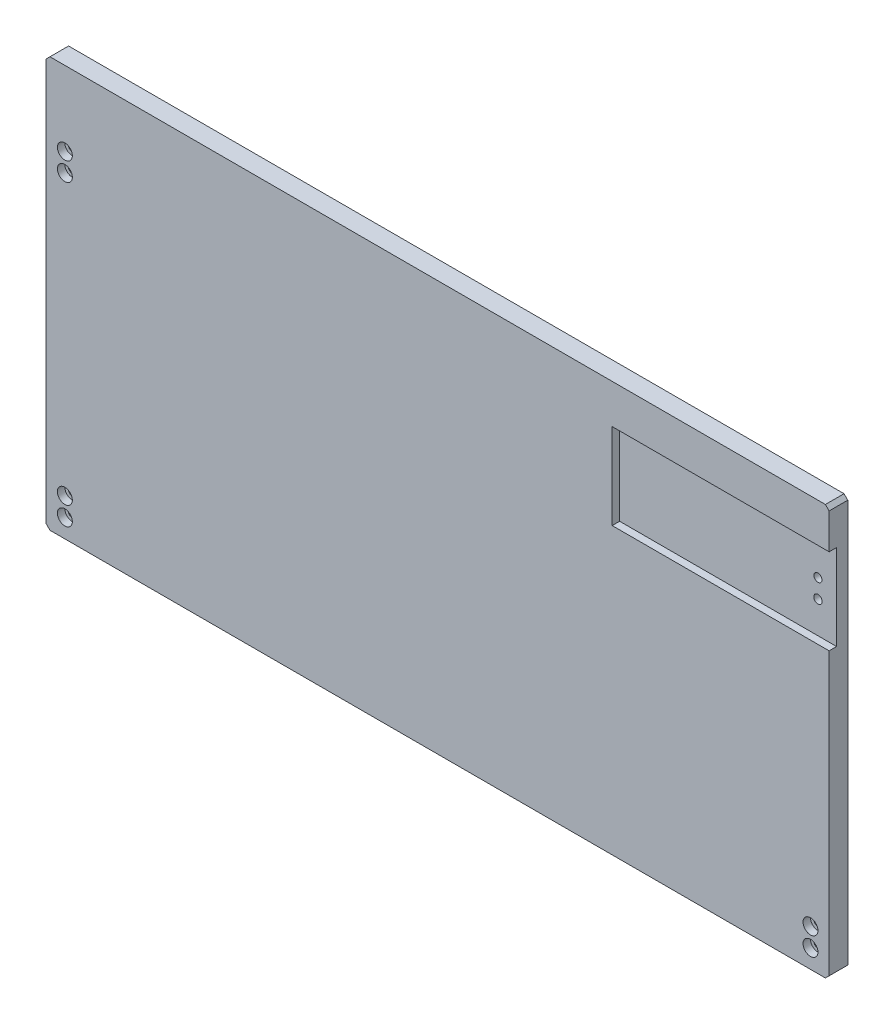
ISO-10303-21;
HEADER;
FILE_DESCRIPTION(('STEP AP214'),'2;1');
FILE_NAME('part.step','',(''),(''),'','','');
FILE_SCHEMA(('AUTOMOTIVE_DESIGN { 1 0 10303 214 1 1 1 1 }'));
ENDSEC;
DATA;
#1=APPLICATION_CONTEXT('core data for automotive mechanical design processes');
#2=APPLICATION_PROTOCOL_DEFINITION('international standard','automotive_design',2000,#1);
#3=PRODUCT_CONTEXT('',#1,'mechanical');
#4=PRODUCT('Part','Part','',(#3));
#5=PRODUCT_RELATED_PRODUCT_CATEGORY('part','',(#4));
#6=PRODUCT_DEFINITION_FORMATION('','',#4);
#7=PRODUCT_DEFINITION_CONTEXT('part definition',#1,'design');
#8=PRODUCT_DEFINITION('design','',#6,#7);
#9=PRODUCT_DEFINITION_SHAPE('','',#8);
#10=(LENGTH_UNIT() NAMED_UNIT(*) SI_UNIT(.MILLI.,.METRE.));
#11=(NAMED_UNIT(*) PLANE_ANGLE_UNIT() SI_UNIT($,.RADIAN.));
#12=(NAMED_UNIT(*) SI_UNIT($,.STERADIAN.) SOLID_ANGLE_UNIT());
#13=UNCERTAINTY_MEASURE_WITH_UNIT(LENGTH_MEASURE(1.E-05),#10,'distance_accuracy_value','');
#14=(GEOMETRIC_REPRESENTATION_CONTEXT(3) GLOBAL_UNCERTAINTY_ASSIGNED_CONTEXT((#13)) GLOBAL_UNIT_ASSIGNED_CONTEXT((#10,
#11,#12)) REPRESENTATION_CONTEXT('',''));
#15=CARTESIAN_POINT('',(0.,0.,0.));
#16=DIRECTION('',(0.,0.,1.));
#17=DIRECTION('',(1.,0.,0.));
#18=AXIS2_PLACEMENT_3D('',#15,#16,#17);
#19=CARTESIAN_POINT('',(200.,-90.,0.));
#20=DIRECTION('',(0.,0.,1.));
#21=DIRECTION('',(1.,0.,0.));
#22=AXIS2_PLACEMENT_3D('',#19,#20,#21);
#23=CYLINDRICAL_SURFACE('',#22,2.15000000000001);
#24=CARTESIAN_POINT('',(200.,-90.,0.));
#25=DIRECTION('',(0.,0.,1.));
#26=DIRECTION('',(1.,0.,0.));
#27=AXIS2_PLACEMENT_3D('',#24,#25,#26);
#28=CIRCLE('',#27,2.15000000000001);
#29=CARTESIAN_POINT('',(202.15,-90.,0.));
#30=VERTEX_POINT('',#29);
#31=EDGE_CURVE('E260',#30,#30,#28,.T.);
#32=ORIENTED_EDGE('',*,*,#31,.F.);
#33=EDGE_LOOP('',(#32));
#34=FACE_BOUND('',#33,.T.);
#35=CARTESIAN_POINT('',(200.,-90.,6.));
#36=DIRECTION('',(0.,0.,1.));
#37=DIRECTION('',(1.,0.,0.));
#38=AXIS2_PLACEMENT_3D('',#35,#36,#37);
#39=CIRCLE('',#38,2.15000000000001);
#40=CARTESIAN_POINT('',(202.15,-90.,6.));
#41=VERTEX_POINT('',#40);
#42=EDGE_CURVE('E43',#41,#41,#39,.F.);
#43=ORIENTED_EDGE('',*,*,#42,.F.);
#44=EDGE_LOOP('',(#43));
#45=FACE_BOUND('',#44,.T.);
#46=ADVANCED_FACE('F38',(#34,#45),#23,.F.);
#47=CARTESIAN_POINT('',(-200.,70.,0.));
#48=DIRECTION('',(0.,0.,1.));
#49=DIRECTION('',(1.,0.,0.));
#50=AXIS2_PLACEMENT_3D('',#47,#48,#49);
#51=CYLINDRICAL_SURFACE('',#50,2.15000000000001);
#52=CARTESIAN_POINT('',(-200.,70.,0.));
#53=DIRECTION('',(0.,0.,1.));
#54=DIRECTION('',(1.,0.,0.));
#55=AXIS2_PLACEMENT_3D('',#52,#53,#54);
#56=CIRCLE('',#55,2.15000000000001);
#57=CARTESIAN_POINT('',(-197.85,70.,0.));
#58=VERTEX_POINT('',#57);
#59=EDGE_CURVE('E269',#58,#58,#56,.T.);
#60=ORIENTED_EDGE('',*,*,#59,.F.);
#61=EDGE_LOOP('',(#60));
#62=FACE_BOUND('',#61,.T.);
#63=CARTESIAN_POINT('',(-200.,70.,6.));
#64=DIRECTION('',(0.,0.,1.));
#65=DIRECTION('',(1.,0.,0.));
#66=AXIS2_PLACEMENT_3D('',#63,#64,#65);
#67=CIRCLE('',#66,2.15000000000001);
#68=CARTESIAN_POINT('',(-197.85,70.,6.));
#69=VERTEX_POINT('',#68);
#70=EDGE_CURVE('E263',#69,#69,#67,.F.);
#71=ORIENTED_EDGE('',*,*,#70,.F.);
#72=EDGE_LOOP('',(#71));
#73=FACE_BOUND('',#72,.T.);
#74=ADVANCED_FACE('F344',(#62,#73),#51,.F.);
#75=CARTESIAN_POINT('',(-200.,-90.,0.));
#76=DIRECTION('',(0.,0.,1.));
#77=DIRECTION('',(1.,0.,0.));
#78=AXIS2_PLACEMENT_3D('',#75,#76,#77);
#79=CYLINDRICAL_SURFACE('',#78,2.15000000000001);
#80=CARTESIAN_POINT('',(-200.,-90.,0.));
#81=DIRECTION('',(0.,0.,1.));
#82=DIRECTION('',(1.,0.,0.));
#83=AXIS2_PLACEMENT_3D('',#80,#81,#82);
#84=CIRCLE('',#83,2.15000000000001);
#85=CARTESIAN_POINT('',(-197.85,-90.,0.));
#86=VERTEX_POINT('',#85);
#87=EDGE_CURVE('E273',#86,#86,#84,.T.);
#88=ORIENTED_EDGE('',*,*,#87,.F.);
#89=EDGE_LOOP('',(#88));
#90=FACE_BOUND('',#89,.T.);
#91=CARTESIAN_POINT('',(-200.,-90.,6.));
#92=DIRECTION('',(0.,0.,1.));
#93=DIRECTION('',(1.,0.,0.));
#94=AXIS2_PLACEMENT_3D('',#91,#92,#93);
#95=CIRCLE('',#94,2.15000000000001);
#96=CARTESIAN_POINT('',(-197.85,-90.,6.));
#97=VERTEX_POINT('',#96);
#98=EDGE_CURVE('E261',#97,#97,#95,.F.);
#99=ORIENTED_EDGE('',*,*,#98,.F.);
#100=EDGE_LOOP('',(#99));
#101=FACE_BOUND('',#100,.T.);
#102=ADVANCED_FACE('F350',(#90,#101),#79,.F.);
#103=CARTESIAN_POINT('',(-200.,60.,0.));
#104=DIRECTION('',(0.,0.,1.));
#105=DIRECTION('',(1.,0.,0.));
#106=AXIS2_PLACEMENT_3D('',#103,#104,#105);
#107=CYLINDRICAL_SURFACE('',#106,2.25000000000001);
#108=CARTESIAN_POINT('',(-200.,60.,0.));
#109=DIRECTION('',(0.,0.,1.));
#110=DIRECTION('',(1.,0.,0.));
#111=AXIS2_PLACEMENT_3D('',#108,#109,#110);
#112=CIRCLE('',#111,2.25000000000001);
#113=CARTESIAN_POINT('',(-197.75,60.,0.));
#114=VERTEX_POINT('',#113);
#115=EDGE_CURVE('E183',#114,#114,#112,.T.);
#116=ORIENTED_EDGE('',*,*,#115,.F.);
#117=EDGE_LOOP('',(#116));
#118=FACE_BOUND('',#117,.T.);
#119=CARTESIAN_POINT('',(-200.,60.,6.));
#120=DIRECTION('',(0.,0.,1.));
#121=DIRECTION('',(1.,0.,0.));
#122=AXIS2_PLACEMENT_3D('',#119,#120,#121);
#123=CIRCLE('',#122,2.25000000000001);
#124=CARTESIAN_POINT('',(-197.75,60.,6.));
#125=VERTEX_POINT('',#124);
#126=EDGE_CURVE('E190',#125,#125,#123,.F.);
#127=ORIENTED_EDGE('',*,*,#126,.F.);
#128=EDGE_LOOP('',(#127));
#129=FACE_BOUND('',#128,.T.);
#130=ADVANCED_FACE('F395',(#118,#129),#107,.F.);
#131=CARTESIAN_POINT('',(200.,60.,0.));
#132=DIRECTION('',(0.,0.,1.));
#133=DIRECTION('',(1.,0.,0.));
#134=AXIS2_PLACEMENT_3D('',#131,#132,#133);
#135=CYLINDRICAL_SURFACE('',#134,2.25000000000001);
#136=CARTESIAN_POINT('',(200.,60.,0.));
#137=DIRECTION('',(0.,0.,1.));
#138=DIRECTION('',(-1.,0.,0.));
#139=AXIS2_PLACEMENT_3D('',#136,#137,#138);
#140=CIRCLE('',#139,2.25000000000001);
#141=CARTESIAN_POINT('',(197.75,60.,0.));
#142=VERTEX_POINT('',#141);
#143=EDGE_CURVE('E180',#142,#142,#140,.T.);
#144=ORIENTED_EDGE('',*,*,#143,.F.);
#145=EDGE_LOOP('',(#144));
#146=FACE_BOUND('',#145,.T.);
#147=CARTESIAN_POINT('',(200.,60.,6.));
#148=DIRECTION('',(0.,0.,1.));
#149=DIRECTION('',(1.,0.,0.));
#150=AXIS2_PLACEMENT_3D('',#147,#148,#149);
#151=CIRCLE('',#150,2.25000000000001);
#152=CARTESIAN_POINT('',(202.25,60.,6.));
#153=VERTEX_POINT('',#152);
#154=EDGE_CURVE('E220',#153,#153,#151,.F.);
#155=ORIENTED_EDGE('',*,*,#154,.F.);
#156=EDGE_LOOP('',(#155));
#157=FACE_BOUND('',#156,.T.);
#158=ADVANCED_FACE('F391',(#146,#157),#135,.F.);
#159=CARTESIAN_POINT('',(200.,-100.,0.));
#160=DIRECTION('',(0.,0.,1.));
#161=DIRECTION('',(1.,0.,0.));
#162=AXIS2_PLACEMENT_3D('',#159,#160,#161);
#163=CYLINDRICAL_SURFACE('',#162,2.25000000000001);
#164=CARTESIAN_POINT('',(200.,-100.,0.));
#165=DIRECTION('',(0.,0.,1.));
#166=DIRECTION('',(1.,0.,0.));
#167=AXIS2_PLACEMENT_3D('',#164,#165,#166);
#168=CIRCLE('',#167,2.25000000000001);
#169=CARTESIAN_POINT('',(202.25,-100.,0.));
#170=VERTEX_POINT('',#169);
#171=EDGE_CURVE('E184',#170,#170,#168,.T.);
#172=ORIENTED_EDGE('',*,*,#171,.F.);
#173=EDGE_LOOP('',(#172));
#174=FACE_BOUND('',#173,.T.);
#175=CARTESIAN_POINT('',(200.,-100.,6.));
#176=DIRECTION('',(0.,0.,1.));
#177=DIRECTION('',(1.,0.,0.));
#178=AXIS2_PLACEMENT_3D('',#175,#176,#177);
#179=CIRCLE('',#178,2.25000000000001);
#180=CARTESIAN_POINT('',(202.25,-100.,6.));
#181=VERTEX_POINT('',#180);
#182=EDGE_CURVE('E217',#181,#181,#179,.F.);
#183=ORIENTED_EDGE('',*,*,#182,.F.);
#184=EDGE_LOOP('',(#183));
#185=FACE_BOUND('',#184,.T.);
#186=ADVANCED_FACE('F394',(#174,#185),#163,.F.);
#187=CARTESIAN_POINT('',(-200.,-100.,0.));
#188=DIRECTION('',(0.,0.,1.));
#189=DIRECTION('',(1.,0.,0.));
#190=AXIS2_PLACEMENT_3D('',#187,#188,#189);
#191=CYLINDRICAL_SURFACE('',#190,2.25000000000001);
#192=CARTESIAN_POINT('',(-200.,-100.,0.));
#193=DIRECTION('',(0.,0.,1.));
#194=DIRECTION('',(-1.,0.,0.));
#195=AXIS2_PLACEMENT_3D('',#192,#193,#194);
#196=CIRCLE('',#195,2.25000000000001);
#197=CARTESIAN_POINT('',(-202.25,-100.,0.));
#198=VERTEX_POINT('',#197);
#199=EDGE_CURVE('E187',#198,#198,#196,.T.);
#200=ORIENTED_EDGE('',*,*,#199,.F.);
#201=EDGE_LOOP('',(#200));
#202=FACE_BOUND('',#201,.T.);
#203=CARTESIAN_POINT('',(-200.,-100.,6.));
#204=DIRECTION('',(0.,0.,1.));
#205=DIRECTION('',(1.,0.,0.));
#206=AXIS2_PLACEMENT_3D('',#203,#204,#205);
#207=CIRCLE('',#206,2.25000000000001);
#208=CARTESIAN_POINT('',(-197.75,-100.,6.));
#209=VERTEX_POINT('',#208);
#210=EDGE_CURVE('E177',#209,#209,#207,.F.);
#211=ORIENTED_EDGE('',*,*,#210,.F.);
#212=EDGE_LOOP('',(#211));
#213=FACE_BOUND('',#212,.T.);
#214=ADVANCED_FACE('F399',(#202,#213),#191,.F.);
#215=CARTESIAN_POINT('',(210.,-110.,10.));
#216=DIRECTION('',(-1.,0.,0.));
#217=DIRECTION('',(0.,0.,1.));
#218=AXIS2_PLACEMENT_3D('',#215,#216,#217);
#219=PLANE('',#218);
#220=DIRECTION('',(0.,1.,0.));
#221=VECTOR('',#220,1.);
#222=CARTESIAN_POINT('',(210.,-110.,10.));
#223=LINE('',#222,#221);
#224=CARTESIAN_POINT('',(210.,89.,10.));
#225=VERTEX_POINT('',#224);
#226=CARTESIAN_POINT('',(210.,108.,10.));
#227=VERTEX_POINT('',#226);
#228=EDGE_CURVE('E196',#225,#227,#223,.T.);
#229=ORIENTED_EDGE('',*,*,#228,.F.);
#230=DIRECTION('',(0.,0.,1.));
#231=VECTOR('',#230,1.);
#232=CARTESIAN_POINT('',(210.,89.,10.));
#233=LINE('',#232,#231);
#234=CARTESIAN_POINT('',(210.,89.,6.));
#235=VERTEX_POINT('',#234);
#236=EDGE_CURVE('E148',#235,#225,#233,.T.);
#237=ORIENTED_EDGE('',*,*,#236,.F.);
#238=DIRECTION('',(0.,1.,0.));
#239=VECTOR('',#238,1.);
#240=CARTESIAN_POINT('',(210.,89.,6.));
#241=LINE('',#240,#239);
#242=CARTESIAN_POINT('',(210.,43.,5.99999999999999));
#243=VERTEX_POINT('',#242);
#244=EDGE_CURVE('E290',#243,#235,#241,.T.);
#245=ORIENTED_EDGE('',*,*,#244,.F.);
#246=DIRECTION('',(0.,0.,-1.));
#247=VECTOR('',#246,1.);
#248=CARTESIAN_POINT('',(210.,43.,9.99999999999999));
#249=LINE('',#248,#247);
#250=CARTESIAN_POINT('',(210.,43.,9.99999999999999));
#251=VERTEX_POINT('',#250);
#252=EDGE_CURVE('E259',#251,#243,#249,.T.);
#253=ORIENTED_EDGE('',*,*,#252,.F.);
#254=CARTESIAN_POINT('',(210.,-108.,10.));
#255=VERTEX_POINT('',#254);
#256=EDGE_CURVE('E153',#255,#251,#223,.T.);
#257=ORIENTED_EDGE('',*,*,#256,.F.);
#258=DIRECTION('',(0.,0.,-1.));
#259=VECTOR('',#258,1.);
#260=CARTESIAN_POINT('',(210.,-108.,10.));
#261=LINE('',#260,#259);
#262=CARTESIAN_POINT('',(210.,-108.,0.));
#263=VERTEX_POINT('',#262);
#264=EDGE_CURVE('E48',#255,#263,#261,.T.);
#265=ORIENTED_EDGE('',*,*,#264,.T.);
#266=DIRECTION('',(0.,1.,0.));
#267=VECTOR('',#266,1.);
#268=CARTESIAN_POINT('',(210.,-110.,0.));
#269=LINE('',#268,#267);
#270=CARTESIAN_POINT('',(210.,108.,0.));
#271=VERTEX_POINT('',#270);
#272=EDGE_CURVE('E193',#263,#271,#269,.T.);
#273=ORIENTED_EDGE('',*,*,#272,.T.);
#274=DIRECTION('',(0.,0.,1.));
#275=VECTOR('',#274,1.);
#276=CARTESIAN_POINT('',(210.,108.,10.));
#277=LINE('',#276,#275);
#278=EDGE_CURVE('E11',#271,#227,#277,.T.);
#279=ORIENTED_EDGE('',*,*,#278,.T.);
#280=EDGE_LOOP('',(#229,#237,#245,#253,#257,#265,#273,#279));
#281=FACE_BOUND('',#280,.T.);
#282=ADVANCED_FACE('F302',(#281),#219,.F.);
#283=CARTESIAN_POINT('',(-210.,110.,10.));
#284=DIRECTION('',(0.,-1.,0.));
#285=DIRECTION('',(0.,0.,-1.));
#286=AXIS2_PLACEMENT_3D('',#283,#284,#285);
#287=PLANE('',#286);
#288=DIRECTION('',(-1.,0.,0.));
#289=VECTOR('',#288,1.);
#290=CARTESIAN_POINT('',(-210.,110.,0.));
#291=LINE('',#290,#289);
#292=CARTESIAN_POINT('',(208.,110.,0.));
#293=VERTEX_POINT('',#292);
#294=CARTESIAN_POINT('',(-208.,110.,0.));
#295=VERTEX_POINT('',#294);
#296=EDGE_CURVE('E207',#293,#295,#291,.T.);
#297=ORIENTED_EDGE('',*,*,#296,.T.);
#298=DIRECTION('',(0.,0.,1.));
#299=VECTOR('',#298,1.);
#300=CARTESIAN_POINT('',(-208.,110.,10.));
#301=LINE('',#300,#299);
#302=CARTESIAN_POINT('',(-208.,110.,10.));
#303=VERTEX_POINT('',#302);
#304=EDGE_CURVE('E64',#295,#303,#301,.T.);
#305=ORIENTED_EDGE('',*,*,#304,.T.);
#306=DIRECTION('',(-1.,0.,0.));
#307=VECTOR('',#306,1.);
#308=CARTESIAN_POINT('',(-210.,110.,10.));
#309=LINE('',#308,#307);
#310=CARTESIAN_POINT('',(208.,110.,10.));
#311=VERTEX_POINT('',#310);
#312=EDGE_CURVE('E195',#311,#303,#309,.T.);
#313=ORIENTED_EDGE('',*,*,#312,.F.);
#314=DIRECTION('',(0.,0.,-1.));
#315=VECTOR('',#314,1.);
#316=CARTESIAN_POINT('',(208.,110.,10.));
#317=LINE('',#316,#315);
#318=EDGE_CURVE('E250',#311,#293,#317,.T.);
#319=ORIENTED_EDGE('',*,*,#318,.T.);
#320=EDGE_LOOP('',(#297,#305,#313,#319));
#321=FACE_BOUND('',#320,.T.);
#322=ADVANCED_FACE('F308',(#321),#287,.F.);
#323=CARTESIAN_POINT('',(-210.,-110.,10.));
#324=DIRECTION('',(1.,0.,0.));
#325=DIRECTION('',(0.,0.,-1.));
#326=AXIS2_PLACEMENT_3D('',#323,#324,#325);
#327=PLANE('',#326);
#328=DIRECTION('',(0.,-1.,0.));
#329=VECTOR('',#328,1.);
#330=CARTESIAN_POINT('',(-210.,-110.,0.));
#331=LINE('',#330,#329);
#332=CARTESIAN_POINT('',(-210.,108.,0.));
#333=VERTEX_POINT('',#332);
#334=CARTESIAN_POINT('',(-210.,-108.,0.));
#335=VERTEX_POINT('',#334);
#336=EDGE_CURVE('E209',#333,#335,#331,.T.);
#337=ORIENTED_EDGE('',*,*,#336,.T.);
#338=DIRECTION('',(0.,0.,1.));
#339=VECTOR('',#338,1.);
#340=CARTESIAN_POINT('',(-210.,-108.,10.));
#341=LINE('',#340,#339);
#342=CARTESIAN_POINT('',(-210.,-108.,10.));
#343=VERTEX_POINT('',#342);
#344=EDGE_CURVE('E240',#335,#343,#341,.T.);
#345=ORIENTED_EDGE('',*,*,#344,.T.);
#346=DIRECTION('',(0.,-1.,0.));
#347=VECTOR('',#346,1.);
#348=CARTESIAN_POINT('',(-210.,-110.,10.));
#349=LINE('',#348,#347);
#350=CARTESIAN_POINT('',(-210.,108.,10.));
#351=VERTEX_POINT('',#350);
#352=EDGE_CURVE('E198',#351,#343,#349,.T.);
#353=ORIENTED_EDGE('',*,*,#352,.F.);
#354=DIRECTION('',(0.,0.,-1.));
#355=VECTOR('',#354,1.);
#356=CARTESIAN_POINT('',(-210.,108.,10.));
#357=LINE('',#356,#355);
#358=EDGE_CURVE('E237',#351,#333,#357,.T.);
#359=ORIENTED_EDGE('',*,*,#358,.T.);
#360=EDGE_LOOP('',(#337,#345,#353,#359));
#361=FACE_BOUND('',#360,.T.);
#362=ADVANCED_FACE('F329',(#361),#327,.F.);
#363=CARTESIAN_POINT('',(-210.,-110.,10.));
#364=DIRECTION('',(0.,1.,0.));
#365=DIRECTION('',(0.,0.,1.));
#366=AXIS2_PLACEMENT_3D('',#363,#364,#365);
#367=PLANE('',#366);
#368=DIRECTION('',(1.,0.,0.));
#369=VECTOR('',#368,1.);
#370=CARTESIAN_POINT('',(-210.,-110.,10.));
#371=LINE('',#370,#369);
#372=CARTESIAN_POINT('',(-208.,-110.,10.));
#373=VERTEX_POINT('',#372);
#374=CARTESIAN_POINT('',(208.,-110.,10.));
#375=VERTEX_POINT('',#374);
#376=EDGE_CURVE('E201',#373,#375,#371,.T.);
#377=ORIENTED_EDGE('',*,*,#376,.F.);
#378=DIRECTION('',(0.,0.,-1.));
#379=VECTOR('',#378,1.);
#380=CARTESIAN_POINT('',(-208.,-110.,10.));
#381=LINE('',#380,#379);
#382=CARTESIAN_POINT('',(-208.,-110.,0.));
#383=VERTEX_POINT('',#382);
#384=EDGE_CURVE('E226',#373,#383,#381,.T.);
#385=ORIENTED_EDGE('',*,*,#384,.T.);
#386=DIRECTION('',(1.,0.,0.));
#387=VECTOR('',#386,1.);
#388=CARTESIAN_POINT('',(-210.,-110.,0.));
#389=LINE('',#388,#387);
#390=CARTESIAN_POINT('',(208.,-110.,0.));
#391=VERTEX_POINT('',#390);
#392=EDGE_CURVE('E212',#383,#391,#389,.T.);
#393=ORIENTED_EDGE('',*,*,#392,.T.);
#394=DIRECTION('',(0.,0.,1.));
#395=VECTOR('',#394,1.);
#396=CARTESIAN_POINT('',(208.,-110.,10.));
#397=LINE('',#396,#395);
#398=EDGE_CURVE('E204',#391,#375,#397,.T.);
#399=ORIENTED_EDGE('',*,*,#398,.T.);
#400=EDGE_LOOP('',(#377,#385,#393,#399));
#401=FACE_BOUND('',#400,.T.);
#402=ADVANCED_FACE('F321',(#401),#367,.F.);
#403=CARTESIAN_POINT('',(0.,0.,10.));
#404=DIRECTION('',(0.,0.,-1.));
#405=DIRECTION('',(-1.,0.,0.));
#406=AXIS2_PLACEMENT_3D('',#403,#404,#405);
#407=PLANE('',#406);
#408=CARTESIAN_POINT('',(-200.,70.,10.));
#409=DIRECTION('',(0.,0.,1.));
#410=DIRECTION('',(1.,0.,0.));
#411=AXIS2_PLACEMENT_3D('',#408,#409,#410);
#412=CIRCLE('',#411,3.99999999999999);
#413=CARTESIAN_POINT('',(-196.,70.,10.));
#414=VERTEX_POINT('',#413);
#415=EDGE_CURVE('E702',#414,#414,#412,.T.);
#416=ORIENTED_EDGE('',*,*,#415,.F.);
#417=EDGE_LOOP('',(#416));
#418=FACE_BOUND('',#417,.T.);
#419=CARTESIAN_POINT('',(-200.,-89.9999999999999,10.));
#420=DIRECTION('',(0.,0.,1.));
#421=DIRECTION('',(1.,0.,0.));
#422=AXIS2_PLACEMENT_3D('',#419,#420,#421);
#423=CIRCLE('',#422,3.99999999999999);
#424=CARTESIAN_POINT('',(-196.,-89.9999999999999,10.));
#425=VERTEX_POINT('',#424);
#426=EDGE_CURVE('E695',#425,#425,#423,.T.);
#427=ORIENTED_EDGE('',*,*,#426,.F.);
#428=EDGE_LOOP('',(#427));
#429=FACE_BOUND('',#428,.T.);
#430=CARTESIAN_POINT('',(200.,-90.,10.));
#431=DIRECTION('',(0.,0.,1.));
#432=DIRECTION('',(1.,0.,0.));
#433=AXIS2_PLACEMENT_3D('',#430,#431,#432);
#434=CIRCLE('',#433,3.99999999999999);
#435=CARTESIAN_POINT('',(204.,-90.,10.));
#436=VERTEX_POINT('',#435);
#437=EDGE_CURVE('E282',#436,#436,#434,.T.);
#438=ORIENTED_EDGE('',*,*,#437,.F.);
#439=EDGE_LOOP('',(#438));
#440=FACE_BOUND('',#439,.T.);
#441=CARTESIAN_POINT('',(-200.,-100.,10.));
#442=DIRECTION('',(0.,0.,1.));
#443=DIRECTION('',(1.,0.,0.));
#444=AXIS2_PLACEMENT_3D('',#441,#442,#443);
#445=CIRCLE('',#444,3.99999999999999);
#446=CARTESIAN_POINT('',(-196.,-100.,10.));
#447=VERTEX_POINT('',#446);
#448=EDGE_CURVE('E163',#447,#447,#445,.T.);
#449=ORIENTED_EDGE('',*,*,#448,.F.);
#450=EDGE_LOOP('',(#449));
#451=FACE_BOUND('',#450,.T.);
#452=CARTESIAN_POINT('',(200.,-100.,10.));
#453=DIRECTION('',(0.,0.,1.));
#454=DIRECTION('',(1.,0.,0.));
#455=AXIS2_PLACEMENT_3D('',#452,#453,#454);
#456=CIRCLE('',#455,3.99999999999999);
#457=CARTESIAN_POINT('',(204.,-100.,10.));
#458=VERTEX_POINT('',#457);
#459=EDGE_CURVE('E164',#458,#458,#456,.T.);
#460=ORIENTED_EDGE('',*,*,#459,.F.);
#461=EDGE_LOOP('',(#460));
#462=FACE_BOUND('',#461,.T.);
#463=CARTESIAN_POINT('',(-200.,60.,10.));
#464=DIRECTION('',(0.,0.,1.));
#465=DIRECTION('',(1.,0.,0.));
#466=AXIS2_PLACEMENT_3D('',#463,#464,#465);
#467=CIRCLE('',#466,3.99999999999999);
#468=CARTESIAN_POINT('',(-196.,60.,10.));
#469=VERTEX_POINT('',#468);
#470=EDGE_CURVE('E171',#469,#469,#467,.T.);
#471=ORIENTED_EDGE('',*,*,#470,.F.);
#472=EDGE_LOOP('',(#471));
#473=FACE_BOUND('',#472,.T.);
#474=DIRECTION('',(0.,-1.,0.));
#475=VECTOR('',#474,1.);
#476=CARTESIAN_POINT('',(93.6199999999999,89.,10.));
#477=LINE('',#476,#475);
#478=CARTESIAN_POINT('',(93.6199999999999,89.,10.));
#479=VERTEX_POINT('',#478);
#480=CARTESIAN_POINT('',(93.6199999999999,43.,9.99999999999999));
#481=VERTEX_POINT('',#480);
#482=EDGE_CURVE('E142',#479,#481,#477,.T.);
#483=ORIENTED_EDGE('',*,*,#482,.F.);
#484=DIRECTION('',(1.,0.,0.));
#485=VECTOR('',#484,1.);
#486=CARTESIAN_POINT('',(93.6199999999999,89.,10.));
#487=LINE('',#486,#485);
#488=EDGE_CURVE('E167',#479,#225,#487,.T.);
#489=ORIENTED_EDGE('',*,*,#488,.T.);
#490=ORIENTED_EDGE('',*,*,#228,.T.);
#491=DIRECTION('',(0.707106781186548,-0.707106781186548,0.));
#492=VECTOR('',#491,1.);
#493=CARTESIAN_POINT('',(208.,110.,10.));
#494=LINE('',#493,#492);
#495=EDGE_CURVE('E244',#227,#311,#494,.F.);
#496=ORIENTED_EDGE('',*,*,#495,.T.);
#497=ORIENTED_EDGE('',*,*,#312,.T.);
#498=DIRECTION('',(0.707106781186557,0.707106781186538,0.));
#499=VECTOR('',#498,1.);
#500=CARTESIAN_POINT('',(-210.,108.,10.));
#501=LINE('',#500,#499);
#502=EDGE_CURVE('E246',#303,#351,#501,.F.);
#503=ORIENTED_EDGE('',*,*,#502,.T.);
#504=ORIENTED_EDGE('',*,*,#352,.T.);
#505=DIRECTION('',(-0.707106781186548,0.707106781186548,0.));
#506=VECTOR('',#505,1.);
#507=CARTESIAN_POINT('',(-208.,-110.,10.));
#508=LINE('',#507,#506);
#509=EDGE_CURVE('E248',#343,#373,#508,.F.);
#510=ORIENTED_EDGE('',*,*,#509,.T.);
#511=ORIENTED_EDGE('',*,*,#376,.T.);
#512=DIRECTION('',(-0.707106781186557,-0.707106781186538,0.));
#513=VECTOR('',#512,1.);
#514=CARTESIAN_POINT('',(210.,-108.,10.));
#515=LINE('',#514,#513);
#516=EDGE_CURVE('E242',#375,#255,#515,.F.);
#517=ORIENTED_EDGE('',*,*,#516,.T.);
#518=ORIENTED_EDGE('',*,*,#256,.T.);
#519=DIRECTION('',(1.,0.,0.));
#520=VECTOR('',#519,1.);
#521=CARTESIAN_POINT('',(93.6199999999999,43.,9.99999999999999));
#522=LINE('',#521,#520);
#523=EDGE_CURVE('E137',#481,#251,#522,.T.);
#524=ORIENTED_EDGE('',*,*,#523,.F.);
#525=EDGE_LOOP('',(#483,#489,#490,#496,#497,#503,#504,#510,#511,#517,#518,#524));
#526=FACE_BOUND('',#525,.T.);
#527=ADVANCED_FACE('F151',(#418,#429,#440,#451,#462,#473,#526),#407,.F.);
#528=CARTESIAN_POINT('',(0.,0.,0.));
#529=DIRECTION('',(0.,0.,-1.));
#530=DIRECTION('',(-1.,0.,0.));
#531=AXIS2_PLACEMENT_3D('',#528,#529,#530);
#532=PLANE('',#531);
#533=CARTESIAN_POINT('',(200.,70.,0.));
#534=DIRECTION('',(0.,0.,1.));
#535=DIRECTION('',(1.,0.,0.));
#536=AXIS2_PLACEMENT_3D('',#533,#534,#535);
#537=CIRCLE('',#536,2.15000000000001);
#538=CARTESIAN_POINT('',(202.15,70.,0.));
#539=VERTEX_POINT('',#538);
#540=EDGE_CURVE('E278',#539,#539,#537,.T.);
#541=ORIENTED_EDGE('',*,*,#540,.T.);
#542=EDGE_LOOP('',(#541));
#543=FACE_BOUND('',#542,.T.);
#544=ORIENTED_EDGE('',*,*,#87,.T.);
#545=EDGE_LOOP('',(#544));
#546=FACE_BOUND('',#545,.T.);
#547=ORIENTED_EDGE('',*,*,#59,.T.);
#548=EDGE_LOOP('',(#547));
#549=FACE_BOUND('',#548,.T.);
#550=ORIENTED_EDGE('',*,*,#31,.T.);
#551=EDGE_LOOP('',(#550));
#552=FACE_BOUND('',#551,.T.);
#553=ORIENTED_EDGE('',*,*,#199,.T.);
#554=EDGE_LOOP('',(#553));
#555=FACE_BOUND('',#554,.T.);
#556=ORIENTED_EDGE('',*,*,#171,.T.);
#557=EDGE_LOOP('',(#556));
#558=FACE_BOUND('',#557,.T.);
#559=ORIENTED_EDGE('',*,*,#143,.T.);
#560=EDGE_LOOP('',(#559));
#561=FACE_BOUND('',#560,.T.);
#562=ORIENTED_EDGE('',*,*,#115,.T.);
#563=EDGE_LOOP('',(#562));
#564=FACE_BOUND('',#563,.T.);
#565=ORIENTED_EDGE('',*,*,#392,.F.);
#566=DIRECTION('',(0.707106781186548,-0.707106781186548,0.));
#567=VECTOR('',#566,1.);
#568=CARTESIAN_POINT('',(-159.,-159.,0.));
#569=LINE('',#568,#567);
#570=EDGE_CURVE('E235',#383,#335,#569,.F.);
#571=ORIENTED_EDGE('',*,*,#570,.T.);
#572=ORIENTED_EDGE('',*,*,#336,.F.);
#573=DIRECTION('',(-0.707106781186557,-0.707106781186538,0.));
#574=VECTOR('',#573,1.);
#575=CARTESIAN_POINT('',(-158.999999999997,159.000000000002,0.));
#576=LINE('',#575,#574);
#577=EDGE_CURVE('E233',#333,#295,#576,.F.);
#578=ORIENTED_EDGE('',*,*,#577,.T.);
#579=ORIENTED_EDGE('',*,*,#296,.F.);
#580=DIRECTION('',(-0.707106781186548,0.707106781186548,0.));
#581=VECTOR('',#580,1.);
#582=CARTESIAN_POINT('',(159.,159.,0.));
#583=LINE('',#582,#581);
#584=EDGE_CURVE('E231',#293,#271,#583,.F.);
#585=ORIENTED_EDGE('',*,*,#584,.T.);
#586=ORIENTED_EDGE('',*,*,#272,.F.);
#587=DIRECTION('',(0.707106781186557,0.707106781186538,0.));
#588=VECTOR('',#587,1.);
#589=CARTESIAN_POINT('',(158.999999999997,-159.000000000001,0.));
#590=LINE('',#589,#588);
#591=EDGE_CURVE('E229',#263,#391,#590,.F.);
#592=ORIENTED_EDGE('',*,*,#591,.T.);
#593=EDGE_LOOP('',(#565,#571,#572,#578,#579,#585,#586,#592));
#594=FACE_BOUND('',#593,.T.);
#595=ADVANCED_FACE('F314',(#543,#546,#549,#552,#555,#558,#561,#564,#594),#532,.T.);
#596=CARTESIAN_POINT('',(-200.,-100.,6.));
#597=DIRECTION('',(0.,0.,1.));
#598=DIRECTION('',(1.,0.,0.));
#599=AXIS2_PLACEMENT_3D('',#596,#597,#598);
#600=PLANE('',#599);
#601=CARTESIAN_POINT('',(-200.,-100.,6.));
#602=DIRECTION('',(0.,0.,1.));
#603=DIRECTION('',(1.,0.,0.));
#604=AXIS2_PLACEMENT_3D('',#601,#602,#603);
#605=CIRCLE('',#604,3.99999999999999);
#606=CARTESIAN_POINT('',(-196.,-100.,6.));
#607=VERTEX_POINT('',#606);
#608=EDGE_CURVE('E168',#607,#607,#605,.T.);
#609=ORIENTED_EDGE('',*,*,#608,.T.);
#610=EDGE_LOOP('',(#609));
#611=FACE_BOUND('',#610,.T.);
#612=ORIENTED_EDGE('',*,*,#210,.T.);
#613=EDGE_LOOP('',(#612));
#614=FACE_BOUND('',#613,.T.);
#615=ADVANCED_FACE('F374',(#611,#614),#600,.T.);
#616=CARTESIAN_POINT('',(-200.,-100.,6.));
#617=DIRECTION('',(0.,0.,1.));
#618=DIRECTION('',(1.,0.,0.));
#619=AXIS2_PLACEMENT_3D('',#616,#617,#618);
#620=CYLINDRICAL_SURFACE('',#619,3.99999999999999);
#621=ORIENTED_EDGE('',*,*,#608,.F.);
#622=EDGE_LOOP('',(#621));
#623=FACE_BOUND('',#622,.T.);
#624=ORIENTED_EDGE('',*,*,#448,.T.);
#625=EDGE_LOOP('',(#624));
#626=FACE_BOUND('',#625,.T.);
#627=ADVANCED_FACE('F369',(#623,#626),#620,.F.);
#628=CARTESIAN_POINT('',(200.,-100.,6.));
#629=DIRECTION('',(0.,0.,1.));
#630=DIRECTION('',(1.,0.,0.));
#631=AXIS2_PLACEMENT_3D('',#628,#629,#630);
#632=PLANE('',#631);
#633=CARTESIAN_POINT('',(200.,-100.,6.));
#634=DIRECTION('',(0.,0.,1.));
#635=DIRECTION('',(1.,0.,0.));
#636=AXIS2_PLACEMENT_3D('',#633,#634,#635);
#637=CIRCLE('',#636,3.99999999999999);
#638=CARTESIAN_POINT('',(204.,-100.,6.));
#639=VERTEX_POINT('',#638);
#640=EDGE_CURVE('E160',#639,#639,#637,.T.);
#641=ORIENTED_EDGE('',*,*,#640,.T.);
#642=EDGE_LOOP('',(#641));
#643=FACE_BOUND('',#642,.T.);
#644=ORIENTED_EDGE('',*,*,#182,.T.);
#645=EDGE_LOOP('',(#644));
#646=FACE_BOUND('',#645,.T.);
#647=ADVANCED_FACE('F365',(#643,#646),#632,.T.);
#648=CARTESIAN_POINT('',(200.,-100.,6.));
#649=DIRECTION('',(0.,0.,1.));
#650=DIRECTION('',(1.,0.,0.));
#651=AXIS2_PLACEMENT_3D('',#648,#649,#650);
#652=CYLINDRICAL_SURFACE('',#651,3.99999999999999);
#653=ORIENTED_EDGE('',*,*,#640,.F.);
#654=EDGE_LOOP('',(#653));
#655=FACE_BOUND('',#654,.T.);
#656=ORIENTED_EDGE('',*,*,#459,.T.);
#657=EDGE_LOOP('',(#656));
#658=FACE_BOUND('',#657,.T.);
#659=ADVANCED_FACE('F368',(#655,#658),#652,.F.);
#660=CARTESIAN_POINT('',(200.,60.,6.));
#661=DIRECTION('',(0.,0.,1.));
#662=DIRECTION('',(1.,0.,0.));
#663=AXIS2_PLACEMENT_3D('',#660,#661,#662);
#664=PLANE('',#663);
#665=CARTESIAN_POINT('',(200.,70.,6.));
#666=DIRECTION('',(0.,0.,1.));
#667=DIRECTION('',(1.,0.,0.));
#668=AXIS2_PLACEMENT_3D('',#665,#666,#667);
#669=CIRCLE('',#668,2.15000000000001);
#670=CARTESIAN_POINT('',(202.15,70.,6.));
#671=VERTEX_POINT('',#670);
#672=EDGE_CURVE('E256',#671,#671,#669,.T.);
#673=ORIENTED_EDGE('',*,*,#672,.F.);
#674=EDGE_LOOP('',(#673));
#675=FACE_BOUND('',#674,.T.);
#676=ORIENTED_EDGE('',*,*,#154,.T.);
#677=EDGE_LOOP('',(#676));
#678=FACE_BOUND('',#677,.T.);
#679=ORIENTED_EDGE('',*,*,#244,.T.);
#680=DIRECTION('',(1.,0.,0.));
#681=VECTOR('',#680,1.);
#682=CARTESIAN_POINT('',(93.6199999999999,89.,6.));
#683=LINE('',#682,#681);
#684=CARTESIAN_POINT('',(93.6199999999999,89.,6.));
#685=VERTEX_POINT('',#684);
#686=EDGE_CURVE('E155',#685,#235,#683,.T.);
#687=ORIENTED_EDGE('',*,*,#686,.F.);
#688=DIRECTION('',(0.,1.,0.));
#689=VECTOR('',#688,1.);
#690=CARTESIAN_POINT('',(93.6199999999999,89.,6.));
#691=LINE('',#690,#689);
#692=CARTESIAN_POINT('',(93.6199999999999,43.,5.99999999999999));
#693=VERTEX_POINT('',#692);
#694=EDGE_CURVE('E141',#693,#685,#691,.T.);
#695=ORIENTED_EDGE('',*,*,#694,.F.);
#696=DIRECTION('',(1.,0.,0.));
#697=VECTOR('',#696,1.);
#698=CARTESIAN_POINT('',(93.6199999999999,43.,5.99999999999999));
#699=LINE('',#698,#697);
#700=EDGE_CURVE('E139',#693,#243,#699,.T.);
#701=ORIENTED_EDGE('',*,*,#700,.T.);
#702=EDGE_LOOP('',(#679,#687,#695,#701));
#703=FACE_BOUND('',#702,.T.);
#704=ADVANCED_FACE('F299',(#675,#678,#703),#664,.T.);
#705=CARTESIAN_POINT('',(-200.,60.,6.));
#706=DIRECTION('',(0.,0.,1.));
#707=DIRECTION('',(1.,0.,0.));
#708=AXIS2_PLACEMENT_3D('',#705,#706,#707);
#709=PLANE('',#708);
#710=CARTESIAN_POINT('',(-200.,60.,6.));
#711=DIRECTION('',(0.,0.,1.));
#712=DIRECTION('',(1.,0.,0.));
#713=AXIS2_PLACEMENT_3D('',#710,#711,#712);
#714=CIRCLE('',#713,3.99999999999999);
#715=CARTESIAN_POINT('',(-196.,60.,6.));
#716=VERTEX_POINT('',#715);
#717=EDGE_CURVE('E174',#716,#716,#714,.T.);
#718=ORIENTED_EDGE('',*,*,#717,.T.);
#719=EDGE_LOOP('',(#718));
#720=FACE_BOUND('',#719,.T.);
#721=ORIENTED_EDGE('',*,*,#126,.T.);
#722=EDGE_LOOP('',(#721));
#723=FACE_BOUND('',#722,.T.);
#724=ADVANCED_FACE('F383',(#720,#723),#709,.T.);
#725=CARTESIAN_POINT('',(-200.,60.,6.));
#726=DIRECTION('',(0.,0.,1.));
#727=DIRECTION('',(1.,0.,0.));
#728=AXIS2_PLACEMENT_3D('',#725,#726,#727);
#729=CYLINDRICAL_SURFACE('',#728,3.99999999999999);
#730=ORIENTED_EDGE('',*,*,#717,.F.);
#731=EDGE_LOOP('',(#730));
#732=FACE_BOUND('',#731,.T.);
#733=ORIENTED_EDGE('',*,*,#470,.T.);
#734=EDGE_LOOP('',(#733));
#735=FACE_BOUND('',#734,.T.);
#736=ADVANCED_FACE('F340',(#732,#735),#729,.F.);
#737=CARTESIAN_POINT('',(-208.,-110.,10.));
#738=DIRECTION('',(0.707106781186548,0.707106781186548,0.));
#739=DIRECTION('',(0.,0.,-1.));
#740=AXIS2_PLACEMENT_3D('',#737,#738,#739);
#741=PLANE('',#740);
#742=ORIENTED_EDGE('',*,*,#509,.F.);
#743=ORIENTED_EDGE('',*,*,#344,.F.);
#744=ORIENTED_EDGE('',*,*,#570,.F.);
#745=ORIENTED_EDGE('',*,*,#384,.F.);
#746=EDGE_LOOP('',(#742,#743,#744,#745));
#747=FACE_BOUND('',#746,.T.);
#748=ADVANCED_FACE('F325',(#747),#741,.F.);
#749=CARTESIAN_POINT('',(-210.,108.,10.));
#750=DIRECTION('',(0.707106781186538,-0.707106781186557,0.));
#751=DIRECTION('',(0.,0.,-1.));
#752=AXIS2_PLACEMENT_3D('',#749,#750,#751);
#753=PLANE('',#752);
#754=ORIENTED_EDGE('',*,*,#502,.F.);
#755=ORIENTED_EDGE('',*,*,#304,.F.);
#756=ORIENTED_EDGE('',*,*,#577,.F.);
#757=ORIENTED_EDGE('',*,*,#358,.F.);
#758=EDGE_LOOP('',(#754,#755,#756,#757));
#759=FACE_BOUND('',#758,.T.);
#760=ADVANCED_FACE('F333',(#759),#753,.F.);
#761=CARTESIAN_POINT('',(208.,110.,10.));
#762=DIRECTION('',(-0.707106781186547,-0.707106781186547,0.));
#763=DIRECTION('',(0.,0.,-1.));
#764=AXIS2_PLACEMENT_3D('',#761,#762,#763);
#765=PLANE('',#764);
#766=ORIENTED_EDGE('',*,*,#495,.F.);
#767=ORIENTED_EDGE('',*,*,#278,.F.);
#768=ORIENTED_EDGE('',*,*,#584,.F.);
#769=ORIENTED_EDGE('',*,*,#318,.F.);
#770=EDGE_LOOP('',(#766,#767,#768,#769));
#771=FACE_BOUND('',#770,.T.);
#772=ADVANCED_FACE('F310',(#771),#765,.F.);
#773=CARTESIAN_POINT('',(210.,-108.,10.));
#774=DIRECTION('',(-0.707106781186538,0.707106781186557,0.));
#775=DIRECTION('',(0.,0.,-1.));
#776=AXIS2_PLACEMENT_3D('',#773,#774,#775);
#777=PLANE('',#776);
#778=ORIENTED_EDGE('',*,*,#516,.F.);
#779=ORIENTED_EDGE('',*,*,#398,.F.);
#780=ORIENTED_EDGE('',*,*,#591,.F.);
#781=ORIENTED_EDGE('',*,*,#264,.F.);
#782=EDGE_LOOP('',(#778,#779,#780,#781));
#783=FACE_BOUND('',#782,.T.);
#784=ADVANCED_FACE('F41',(#783),#777,.F.);
#785=CARTESIAN_POINT('',(93.6199999999999,89.,10.));
#786=DIRECTION('',(0.,1.,0.));
#787=DIRECTION('',(0.,0.,1.));
#788=AXIS2_PLACEMENT_3D('',#785,#786,#787);
#789=PLANE('',#788);
#790=ORIENTED_EDGE('',*,*,#236,.T.);
#791=ORIENTED_EDGE('',*,*,#488,.F.);
#792=DIRECTION('',(0.,0.,1.));
#793=VECTOR('',#792,1.);
#794=CARTESIAN_POINT('',(93.6199999999999,89.,10.));
#795=LINE('',#794,#793);
#796=EDGE_CURVE('E56',#685,#479,#795,.T.);
#797=ORIENTED_EDGE('',*,*,#796,.F.);
#798=ORIENTED_EDGE('',*,*,#686,.T.);
#799=EDGE_LOOP('',(#790,#791,#797,#798));
#800=FACE_BOUND('',#799,.T.);
#801=ADVANCED_FACE('F295',(#800),#789,.F.);
#802=CARTESIAN_POINT('',(93.6199999999999,43.,9.99999999999999));
#803=DIRECTION('',(0.,-1.,0.));
#804=DIRECTION('',(0.,0.,-1.));
#805=AXIS2_PLACEMENT_3D('',#802,#803,#804);
#806=PLANE('',#805);
#807=ORIENTED_EDGE('',*,*,#252,.T.);
#808=ORIENTED_EDGE('',*,*,#700,.F.);
#809=DIRECTION('',(0.,0.,-1.));
#810=VECTOR('',#809,1.);
#811=CARTESIAN_POINT('',(93.6199999999999,43.,9.99999999999999));
#812=LINE('',#811,#810);
#813=EDGE_CURVE('E133',#481,#693,#812,.T.);
#814=ORIENTED_EDGE('',*,*,#813,.F.);
#815=ORIENTED_EDGE('',*,*,#523,.T.);
#816=EDGE_LOOP('',(#807,#808,#814,#815));
#817=FACE_BOUND('',#816,.T.);
#818=ADVANCED_FACE('F135',(#817),#806,.F.);
#819=CARTESIAN_POINT('',(93.6199999999999,0.,0.));
#820=DIRECTION('',(1.,0.,0.));
#821=DIRECTION('',(0.,0.,-1.));
#822=AXIS2_PLACEMENT_3D('',#819,#820,#821);
#823=PLANE('',#822);
#824=ORIENTED_EDGE('',*,*,#482,.T.);
#825=ORIENTED_EDGE('',*,*,#813,.T.);
#826=ORIENTED_EDGE('',*,*,#694,.T.);
#827=ORIENTED_EDGE('',*,*,#796,.T.);
#828=EDGE_LOOP('',(#824,#825,#826,#827));
#829=FACE_BOUND('',#828,.T.);
#830=ADVANCED_FACE('F145',(#829),#823,.T.);
#831=CARTESIAN_POINT('',(200.,70.,0.));
#832=DIRECTION('',(0.,0.,1.));
#833=DIRECTION('',(1.,0.,0.));
#834=AXIS2_PLACEMENT_3D('',#831,#832,#833);
#835=CYLINDRICAL_SURFACE('',#834,2.15000000000001);
#836=ORIENTED_EDGE('',*,*,#672,.T.);
#837=EDGE_LOOP('',(#836));
#838=FACE_BOUND('',#837,.T.);
#839=ORIENTED_EDGE('',*,*,#540,.F.);
#840=EDGE_LOOP('',(#839));
#841=FACE_BOUND('',#840,.T.);
#842=ADVANCED_FACE('F360',(#838,#841),#835,.F.);
#843=CARTESIAN_POINT('',(-200.,-89.9999999999999,6.));
#844=DIRECTION('',(0.,0.,1.));
#845=DIRECTION('',(1.,0.,0.));
#846=AXIS2_PLACEMENT_3D('',#843,#844,#845);
#847=PLANE('',#846);
#848=CARTESIAN_POINT('',(-200.,-89.9999999999999,6.));
#849=DIRECTION('',(0.,0.,1.));
#850=DIRECTION('',(1.,0.,0.));
#851=AXIS2_PLACEMENT_3D('',#848,#849,#850);
#852=CIRCLE('',#851,3.99999999999999);
#853=CARTESIAN_POINT('',(-196.,-89.9999999999999,6.));
#854=VERTEX_POINT('',#853);
#855=EDGE_CURVE('E697',#854,#854,#852,.T.);
#856=ORIENTED_EDGE('',*,*,#855,.T.);
#857=EDGE_LOOP('',(#856));
#858=FACE_BOUND('',#857,.T.);
#859=ORIENTED_EDGE('',*,*,#98,.T.);
#860=EDGE_LOOP('',(#859));
#861=FACE_BOUND('',#860,.T.);
#862=ADVANCED_FACE('F525',(#858,#861),#847,.T.);
#863=CARTESIAN_POINT('',(-200.,-89.9999999999999,6.));
#864=DIRECTION('',(0.,0.,1.));
#865=DIRECTION('',(1.,0.,0.));
#866=AXIS2_PLACEMENT_3D('',#863,#864,#865);
#867=CYLINDRICAL_SURFACE('',#866,3.99999999999999);
#868=ORIENTED_EDGE('',*,*,#855,.F.);
#869=EDGE_LOOP('',(#868));
#870=FACE_BOUND('',#869,.T.);
#871=ORIENTED_EDGE('',*,*,#426,.T.);
#872=EDGE_LOOP('',(#871));
#873=FACE_BOUND('',#872,.T.);
#874=ADVANCED_FACE('F531',(#870,#873),#867,.F.);
#875=CARTESIAN_POINT('',(-200.,70.,6.));
#876=DIRECTION('',(0.,0.,1.));
#877=DIRECTION('',(1.,0.,0.));
#878=AXIS2_PLACEMENT_3D('',#875,#876,#877);
#879=PLANE('',#878);
#880=CARTESIAN_POINT('',(-200.,70.,6.));
#881=DIRECTION('',(0.,0.,1.));
#882=DIRECTION('',(1.,0.,0.));
#883=AXIS2_PLACEMENT_3D('',#880,#881,#882);
#884=CIRCLE('',#883,3.99999999999999);
#885=CARTESIAN_POINT('',(-196.,70.,6.));
#886=VERTEX_POINT('',#885);
#887=EDGE_CURVE('E264',#886,#886,#884,.T.);
#888=ORIENTED_EDGE('',*,*,#887,.T.);
#889=EDGE_LOOP('',(#888));
#890=FACE_BOUND('',#889,.T.);
#891=ORIENTED_EDGE('',*,*,#70,.T.);
#892=EDGE_LOOP('',(#891));
#893=FACE_BOUND('',#892,.T.);
#894=ADVANCED_FACE('F539',(#890,#893),#879,.T.);
#895=CARTESIAN_POINT('',(-200.,70.,6.));
#896=DIRECTION('',(0.,0.,1.));
#897=DIRECTION('',(1.,0.,0.));
#898=AXIS2_PLACEMENT_3D('',#895,#896,#897);
#899=CYLINDRICAL_SURFACE('',#898,3.99999999999999);
#900=ORIENTED_EDGE('',*,*,#887,.F.);
#901=EDGE_LOOP('',(#900));
#902=FACE_BOUND('',#901,.T.);
#903=ORIENTED_EDGE('',*,*,#415,.T.);
#904=EDGE_LOOP('',(#903));
#905=FACE_BOUND('',#904,.T.);
#906=ADVANCED_FACE('F547',(#902,#905),#899,.F.);
#907=CARTESIAN_POINT('',(200.,-90.,6.));
#908=DIRECTION('',(0.,0.,1.));
#909=DIRECTION('',(1.,0.,0.));
#910=AXIS2_PLACEMENT_3D('',#907,#908,#909);
#911=PLANE('',#910);
#912=CARTESIAN_POINT('',(200.,-90.,6.));
#913=DIRECTION('',(0.,0.,1.));
#914=DIRECTION('',(1.,0.,0.));
#915=AXIS2_PLACEMENT_3D('',#912,#913,#914);
#916=CIRCLE('',#915,3.99999999999999);
#917=CARTESIAN_POINT('',(204.,-90.,6.));
#918=VERTEX_POINT('',#917);
#919=EDGE_CURVE('E691',#918,#918,#916,.T.);
#920=ORIENTED_EDGE('',*,*,#919,.T.);
#921=EDGE_LOOP('',(#920));
#922=FACE_BOUND('',#921,.T.);
#923=ORIENTED_EDGE('',*,*,#42,.T.);
#924=EDGE_LOOP('',(#923));
#925=FACE_BOUND('',#924,.T.);
#926=ADVANCED_FACE('F555',(#922,#925),#911,.T.);
#927=CARTESIAN_POINT('',(200.,-90.,6.));
#928=DIRECTION('',(0.,0.,1.));
#929=DIRECTION('',(1.,0.,0.));
#930=AXIS2_PLACEMENT_3D('',#927,#928,#929);
#931=CYLINDRICAL_SURFACE('',#930,3.99999999999999);
#932=ORIENTED_EDGE('',*,*,#919,.F.);
#933=EDGE_LOOP('',(#932));
#934=FACE_BOUND('',#933,.T.);
#935=ORIENTED_EDGE('',*,*,#437,.T.);
#936=EDGE_LOOP('',(#935));
#937=FACE_BOUND('',#936,.T.);
#938=ADVANCED_FACE('F563',(#934,#937),#931,.F.);
#939=CLOSED_SHELL('',(#46,#74,#102,#130,#158,#186,#214,#282,#322,#362,#402,#527,#595,#615,#627,
#647,#659,#704,#724,#736,#748,#760,#772,#784,#801,#818,#830,#842,#862,#874,#894,#906,#926,#938));
#940=MANIFOLD_SOLID_BREP('B2',#939);
#941=ADVANCED_BREP_SHAPE_REPRESENTATION('',(#18,#940),#14);
#942=SHAPE_DEFINITION_REPRESENTATION(#9,#941);
ENDSEC;
END-ISO-10303-21;
